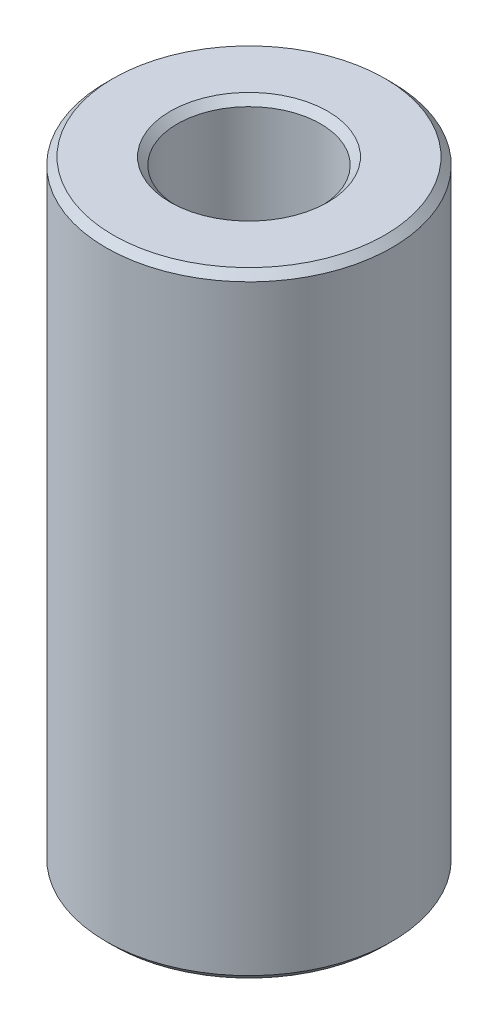
ISO-10303-21;
HEADER;
FILE_DESCRIPTION(('STEP AP214'),'2;1');
FILE_NAME('part.step','',(''),(''),'','','');
FILE_SCHEMA(('AUTOMOTIVE_DESIGN { 1 0 10303 214 1 1 1 1 }'));
ENDSEC;
DATA;
#1=APPLICATION_CONTEXT('core data for automotive mechanical design processes');
#2=APPLICATION_PROTOCOL_DEFINITION('international standard','automotive_design',2000,#1);
#3=PRODUCT_CONTEXT('',#1,'mechanical');
#4=PRODUCT('Part','Part','',(#3));
#5=PRODUCT_RELATED_PRODUCT_CATEGORY('part','',(#4));
#6=PRODUCT_DEFINITION_FORMATION('','',#4);
#7=PRODUCT_DEFINITION_CONTEXT('part definition',#1,'design');
#8=PRODUCT_DEFINITION('design','',#6,#7);
#9=PRODUCT_DEFINITION_SHAPE('','',#8);
#10=(LENGTH_UNIT() NAMED_UNIT(*) SI_UNIT(.MILLI.,.METRE.));
#11=(NAMED_UNIT(*) PLANE_ANGLE_UNIT() SI_UNIT($,.RADIAN.));
#12=(NAMED_UNIT(*) SI_UNIT($,.STERADIAN.) SOLID_ANGLE_UNIT());
#13=UNCERTAINTY_MEASURE_WITH_UNIT(LENGTH_MEASURE(1.E-05),#10,'distance_accuracy_value','');
#14=(GEOMETRIC_REPRESENTATION_CONTEXT(3) GLOBAL_UNCERTAINTY_ASSIGNED_CONTEXT((#13)) GLOBAL_UNIT_ASSIGNED_CONTEXT((#10,
#11,#12)) REPRESENTATION_CONTEXT('',''));
#15=CARTESIAN_POINT('',(0.,0.,0.));
#16=DIRECTION('',(0.,0.,1.));
#17=DIRECTION('',(1.,0.,0.));
#18=AXIS2_PLACEMENT_3D('',#15,#16,#17);
#19=CARTESIAN_POINT('',(0.,53.7752375736066,0.));
#20=DIRECTION('',(0.,-1.,0.));
#21=DIRECTION('',(0.,0.,-1.));
#22=AXIS2_PLACEMENT_3D('',#19,#20,#21);
#23=CYLINDRICAL_SURFACE('',#22,12.5);
#24=CARTESIAN_POINT('',(0.,0.632380506193901,0.));
#25=DIRECTION('',(0.,1.,0.));
#26=DIRECTION('',(0.,0.,1.));
#27=AXIS2_PLACEMENT_3D('',#24,#25,#26);
#28=CIRCLE('',#27,12.5);
#29=CARTESIAN_POINT('',(0.,0.632380506193901,12.5));
#30=VERTEX_POINT('',#29);
#31=EDGE_CURVE('E10',#30,#30,#28,.T.);
#32=ORIENTED_EDGE('',*,*,#31,.T.);
#33=EDGE_LOOP('',(#32));
#34=FACE_BOUND('',#33,.T.);
#35=CARTESIAN_POINT('',(0.,53.1428570674127,0.));
#36=DIRECTION('',(0.,1.,0.));
#37=DIRECTION('',(0.,0.,1.));
#38=AXIS2_PLACEMENT_3D('',#35,#36,#37);
#39=CIRCLE('',#38,12.5);
#40=CARTESIAN_POINT('',(0.,53.1428570674127,12.5));
#41=VERTEX_POINT('',#40);
#42=EDGE_CURVE('E50',#41,#41,#39,.F.);
#43=ORIENTED_EDGE('',*,*,#42,.T.);
#44=EDGE_LOOP('',(#43));
#45=FACE_BOUND('',#44,.T.);
#46=ADVANCED_FACE('F39',(#34,#45),#23,.T.);
#47=CARTESIAN_POINT('',(0.,53.7752375736066,0.));
#48=DIRECTION('',(0.,1.,0.));
#49=DIRECTION('',(0.,0.,1.));
#50=AXIS2_PLACEMENT_3D('',#47,#48,#49);
#51=PLANE('',#50);
#52=CARTESIAN_POINT('',(0.,53.7752375736066,0.));
#53=DIRECTION('',(0.,1.,0.));
#54=DIRECTION('',(0.,0.,1.));
#55=AXIS2_PLACEMENT_3D('',#52,#53,#54);
#56=CIRCLE('',#55,6.88966908791199);
#57=CARTESIAN_POINT('',(0.,53.7752375736066,6.88966908791199));
#58=VERTEX_POINT('',#57);
#59=EDGE_CURVE('E58',#58,#58,#56,.F.);
#60=ORIENTED_EDGE('',*,*,#59,.T.);
#61=EDGE_LOOP('',(#60));
#62=FACE_BOUND('',#61,.T.);
#63=CARTESIAN_POINT('',(0.,53.7752375736066,0.));
#64=DIRECTION('',(0.,1.,0.));
#65=DIRECTION('',(0.,0.,1.));
#66=AXIS2_PLACEMENT_3D('',#63,#64,#65);
#67=CIRCLE('',#66,11.8676194938061);
#68=CARTESIAN_POINT('',(0.,53.7752375736066,11.8676194938061));
#69=VERTEX_POINT('',#68);
#70=EDGE_CURVE('E61',#69,#69,#67,.T.);
#71=ORIENTED_EDGE('',*,*,#70,.T.);
#72=EDGE_LOOP('',(#71));
#73=FACE_BOUND('',#72,.T.);
#74=ADVANCED_FACE('F88',(#62,#73),#51,.T.);
#75=CARTESIAN_POINT('',(0.,0.,0.));
#76=DIRECTION('',(0.,1.,0.));
#77=DIRECTION('',(0.,0.,1.));
#78=AXIS2_PLACEMENT_3D('',#75,#76,#77);
#79=PLANE('',#78);
#80=CARTESIAN_POINT('',(0.,0.,0.));
#81=DIRECTION('',(0.,1.,0.));
#82=DIRECTION('',(0.,0.,1.));
#83=AXIS2_PLACEMENT_3D('',#80,#81,#82);
#84=CIRCLE('',#83,6.88966908791198);
#85=CARTESIAN_POINT('',(0.,0.,6.88966908791198));
#86=VERTEX_POINT('',#85);
#87=EDGE_CURVE('E51',#86,#86,#84,.T.);
#88=ORIENTED_EDGE('',*,*,#87,.T.);
#89=EDGE_LOOP('',(#88));
#90=FACE_BOUND('',#89,.T.);
#91=CARTESIAN_POINT('',(0.,0.,0.));
#92=DIRECTION('',(0.,1.,0.));
#93=DIRECTION('',(0.,0.,1.));
#94=AXIS2_PLACEMENT_3D('',#91,#92,#93);
#95=CIRCLE('',#94,11.8676194938061);
#96=CARTESIAN_POINT('',(0.,0.,11.8676194938061));
#97=VERTEX_POINT('',#96);
#98=EDGE_CURVE('E54',#97,#97,#95,.F.);
#99=ORIENTED_EDGE('',*,*,#98,.T.);
#100=EDGE_LOOP('',(#99));
#101=FACE_BOUND('',#100,.T.);
#102=ADVANCED_FACE('F83',(#90,#101),#79,.F.);
#103=CARTESIAN_POINT('',(0.,53.7752375736066,0.));
#104=DIRECTION('',(0.,-1.,0.));
#105=DIRECTION('',(0.,0.,-1.));
#106=AXIS2_PLACEMENT_3D('',#103,#104,#105);
#107=CYLINDRICAL_SURFACE('',#106,6.25728858171807);
#108=CARTESIAN_POINT('',(0.,53.1428570674127,0.));
#109=DIRECTION('',(0.,1.,0.));
#110=DIRECTION('',(0.,0.,1.));
#111=AXIS2_PLACEMENT_3D('',#108,#109,#110);
#112=CIRCLE('',#111,6.25728858171807);
#113=CARTESIAN_POINT('',(0.,53.1428570674127,6.25728858171807));
#114=VERTEX_POINT('',#113);
#115=EDGE_CURVE('E67',#114,#114,#112,.T.);
#116=ORIENTED_EDGE('',*,*,#115,.T.);
#117=EDGE_LOOP('',(#116));
#118=FACE_BOUND('',#117,.T.);
#119=CARTESIAN_POINT('',(0.,0.632380506193915,0.));
#120=DIRECTION('',(0.,1.,0.));
#121=DIRECTION('',(0.,0.,1.));
#122=AXIS2_PLACEMENT_3D('',#119,#120,#121);
#123=CIRCLE('',#122,6.25728858171807);
#124=CARTESIAN_POINT('',(0.,0.632380506193915,6.25728858171807));
#125=VERTEX_POINT('',#124);
#126=EDGE_CURVE('E69',#125,#125,#123,.F.);
#127=ORIENTED_EDGE('',*,*,#126,.T.);
#128=EDGE_LOOP('',(#127));
#129=FACE_BOUND('',#128,.T.);
#130=ADVANCED_FACE('F71',(#118,#129),#107,.F.);
#131=CARTESIAN_POINT('',(0.,53.1428570674127,0.));
#132=DIRECTION('',(0.,1.,0.));
#133=DIRECTION('',(0.,0.,1.));
#134=AXIS2_PLACEMENT_3D('',#131,#132,#133);
#135=CONICAL_SURFACE('',#134,6.25728858171807,0.785398163397446);
#136=ORIENTED_EDGE('',*,*,#59,.F.);
#137=EDGE_LOOP('',(#136));
#138=FACE_BOUND('',#137,.T.);
#139=ORIENTED_EDGE('',*,*,#115,.F.);
#140=EDGE_LOOP('',(#139));
#141=FACE_BOUND('',#140,.T.);
#142=ADVANCED_FACE('F77',(#138,#141),#135,.F.);
#143=CARTESIAN_POINT('',(0.,0.,0.));
#144=DIRECTION('',(0.,-1.,0.));
#145=DIRECTION('',(0.,0.,-1.));
#146=AXIS2_PLACEMENT_3D('',#143,#144,#145);
#147=CONICAL_SURFACE('',#146,6.88966908791198,0.785398163397446);
#148=ORIENTED_EDGE('',*,*,#126,.F.);
#149=EDGE_LOOP('',(#148));
#150=FACE_BOUND('',#149,.T.);
#151=ORIENTED_EDGE('',*,*,#87,.F.);
#152=EDGE_LOOP('',(#151));
#153=FACE_BOUND('',#152,.T.);
#154=ADVANCED_FACE('F73',(#150,#153),#147,.F.);
#155=CARTESIAN_POINT('',(0.,0.632380506193901,0.));
#156=DIRECTION('',(0.,1.,0.));
#157=DIRECTION('',(0.,0.,1.));
#158=AXIS2_PLACEMENT_3D('',#155,#156,#157);
#159=CONICAL_SURFACE('',#158,12.5,0.78539816339745);
#160=ORIENTED_EDGE('',*,*,#98,.F.);
#161=EDGE_LOOP('',(#160));
#162=FACE_BOUND('',#161,.T.);
#163=ORIENTED_EDGE('',*,*,#31,.F.);
#164=EDGE_LOOP('',(#163));
#165=FACE_BOUND('',#164,.T.);
#166=ADVANCED_FACE('F76',(#162,#165),#159,.T.);
#167=CARTESIAN_POINT('',(0.,53.7752375736066,0.));
#168=DIRECTION('',(0.,-1.,0.));
#169=DIRECTION('',(0.,0.,-1.));
#170=AXIS2_PLACEMENT_3D('',#167,#168,#169);
#171=CONICAL_SURFACE('',#170,11.8676194938061,0.785398163397441);
#172=ORIENTED_EDGE('',*,*,#42,.F.);
#173=EDGE_LOOP('',(#172));
#174=FACE_BOUND('',#173,.T.);
#175=ORIENTED_EDGE('',*,*,#70,.F.);
#176=EDGE_LOOP('',(#175));
#177=FACE_BOUND('',#176,.T.);
#178=ADVANCED_FACE('F45',(#174,#177),#171,.T.);
#179=CLOSED_SHELL('',(#46,#74,#102,#130,#142,#154,#166,#178));
#180=MANIFOLD_SOLID_BREP('B2',#179);
#181=ADVANCED_BREP_SHAPE_REPRESENTATION('',(#18,#180),#14);
#182=SHAPE_DEFINITION_REPRESENTATION(#9,#181);
ENDSEC;
END-ISO-10303-21;
